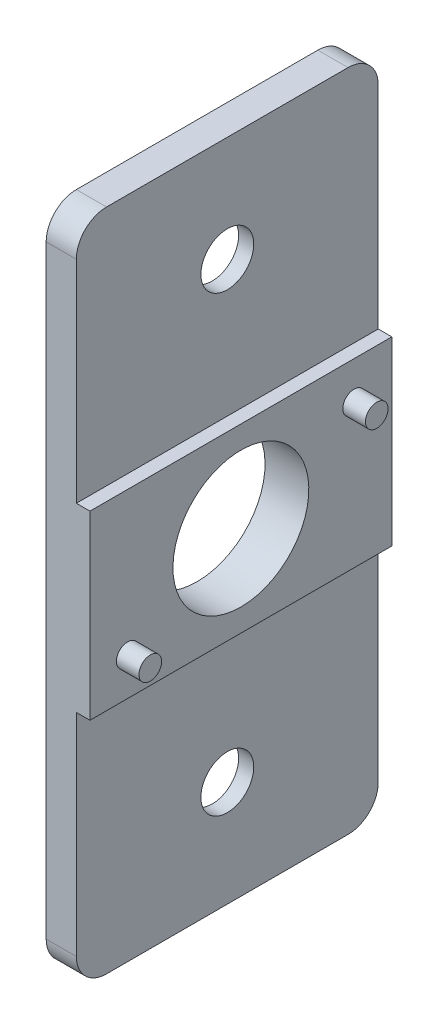
ISO-10303-21;
HEADER;
FILE_DESCRIPTION(('STEP AP214'),'2;1');
FILE_NAME('part.step','',(''),(''),'','','');
FILE_SCHEMA(('AUTOMOTIVE_DESIGN { 1 0 10303 214 1 1 1 1 }'));
ENDSEC;
DATA;
#1=APPLICATION_CONTEXT('core data for automotive mechanical design processes');
#2=APPLICATION_PROTOCOL_DEFINITION('international standard','automotive_design',2000,#1);
#3=PRODUCT_CONTEXT('',#1,'mechanical');
#4=PRODUCT('Part','Part','',(#3));
#5=PRODUCT_RELATED_PRODUCT_CATEGORY('part','',(#4));
#6=PRODUCT_DEFINITION_FORMATION('','',#4);
#7=PRODUCT_DEFINITION_CONTEXT('part definition',#1,'design');
#8=PRODUCT_DEFINITION('design','',#6,#7);
#9=PRODUCT_DEFINITION_SHAPE('','',#8);
#10=(LENGTH_UNIT() NAMED_UNIT(*) SI_UNIT(.MILLI.,.METRE.));
#11=(NAMED_UNIT(*) PLANE_ANGLE_UNIT() SI_UNIT($,.RADIAN.));
#12=(NAMED_UNIT(*) SI_UNIT($,.STERADIAN.) SOLID_ANGLE_UNIT());
#13=UNCERTAINTY_MEASURE_WITH_UNIT(LENGTH_MEASURE(1.E-05),#10,'distance_accuracy_value','');
#14=(GEOMETRIC_REPRESENTATION_CONTEXT(3) GLOBAL_UNCERTAINTY_ASSIGNED_CONTEXT((#13)) GLOBAL_UNIT_ASSIGNED_CONTEXT((#10,
#11,#12)) REPRESENTATION_CONTEXT('',''));
#15=CARTESIAN_POINT('',(0.,0.,0.));
#16=DIRECTION('',(0.,0.,1.));
#17=DIRECTION('',(1.,0.,0.));
#18=AXIS2_PLACEMENT_3D('',#15,#16,#17);
#19=CARTESIAN_POINT('',(2.9,-37.,10.));
#20=DIRECTION('',(-1.,0.,0.));
#21=DIRECTION('',(0.,-1.,0.));
#22=AXIS2_PLACEMENT_3D('',#19,#20,#21);
#23=CYLINDRICAL_SURFACE('',#22,1.75);
#24=CARTESIAN_POINT('',(2.,-37.,10.));
#25=DIRECTION('',(-1.,0.,0.));
#26=DIRECTION('',(0.,0.,1.));
#27=AXIS2_PLACEMENT_3D('',#24,#25,#26);
#28=CIRCLE('',#27,1.75);
#29=CARTESIAN_POINT('',(2.,-37.,11.75));
#30=VERTEX_POINT('',#29);
#31=EDGE_CURVE('E308',#30,#30,#28,.T.);
#32=ORIENTED_EDGE('',*,*,#31,.F.);
#33=EDGE_LOOP('',(#32));
#34=FACE_BOUND('',#33,.T.);
#35=CARTESIAN_POINT('',(1.,-37.,10.));
#36=DIRECTION('',(-1.,0.,0.));
#37=DIRECTION('',(0.,0.,1.));
#38=AXIS2_PLACEMENT_3D('',#35,#36,#37);
#39=CIRCLE('',#38,1.75);
#40=CARTESIAN_POINT('',(1.,-37.,11.75));
#41=VERTEX_POINT('',#40);
#42=EDGE_CURVE('E38',#41,#41,#39,.F.);
#43=ORIENTED_EDGE('',*,*,#42,.F.);
#44=EDGE_LOOP('',(#43));
#45=FACE_BOUND('',#44,.T.);
#46=ADVANCED_FACE('F34',(#34,#45),#23,.F.);
#47=CARTESIAN_POINT('',(2.9,-7.,10.));
#48=DIRECTION('',(-1.,0.,0.));
#49=DIRECTION('',(0.,-1.,0.));
#50=AXIS2_PLACEMENT_3D('',#47,#48,#49);
#51=CYLINDRICAL_SURFACE('',#50,1.75);
#52=CARTESIAN_POINT('',(2.,-7.,10.));
#53=DIRECTION('',(-1.,0.,0.));
#54=DIRECTION('',(0.,0.,1.));
#55=AXIS2_PLACEMENT_3D('',#52,#53,#54);
#56=CIRCLE('',#55,1.75);
#57=CARTESIAN_POINT('',(2.,-7.,11.75));
#58=VERTEX_POINT('',#57);
#59=EDGE_CURVE('E331',#58,#58,#56,.T.);
#60=ORIENTED_EDGE('',*,*,#59,.F.);
#61=EDGE_LOOP('',(#60));
#62=FACE_BOUND('',#61,.T.);
#63=CARTESIAN_POINT('',(1.,-7.,10.));
#64=DIRECTION('',(-1.,0.,0.));
#65=DIRECTION('',(0.,0.,1.));
#66=AXIS2_PLACEMENT_3D('',#63,#64,#65);
#67=CIRCLE('',#66,1.75);
#68=CARTESIAN_POINT('',(1.,-7.,11.75));
#69=VERTEX_POINT('',#68);
#70=EDGE_CURVE('E288',#69,#69,#67,.F.);
#71=ORIENTED_EDGE('',*,*,#70,.F.);
#72=EDGE_LOOP('',(#71));
#73=FACE_BOUND('',#72,.T.);
#74=ADVANCED_FACE('F411',(#62,#73),#51,.F.);
#75=CARTESIAN_POINT('',(2.9,-28.,20.));
#76=DIRECTION('',(-1.,0.,0.));
#77=DIRECTION('',(0.,0.,1.));
#78=AXIS2_PLACEMENT_3D('',#75,#76,#77);
#79=PLANE('',#78);
#80=CARTESIAN_POINT('',(2.9,-25.5,17.5));
#81=DIRECTION('',(-1.,0.,0.));
#82=DIRECTION('',(0.,0.,1.));
#83=AXIS2_PLACEMENT_3D('',#80,#81,#82);
#84=CIRCLE('',#83,0.750000000000002);
#85=CARTESIAN_POINT('',(2.9,-25.5,18.25));
#86=VERTEX_POINT('',#85);
#87=EDGE_CURVE('E364',#86,#86,#84,.F.);
#88=ORIENTED_EDGE('',*,*,#87,.F.);
#89=EDGE_LOOP('',(#88));
#90=FACE_BOUND('',#89,.T.);
#91=CARTESIAN_POINT('',(2.9,-22.,10.));
#92=DIRECTION('',(-1.,0.,0.));
#93=DIRECTION('',(0.,-1.,0.));
#94=AXIS2_PLACEMENT_3D('',#91,#92,#93);
#95=CIRCLE('',#94,4.5);
#96=CARTESIAN_POINT('',(2.9,-26.5,10.));
#97=VERTEX_POINT('',#96);
#98=EDGE_CURVE('E305',#97,#97,#95,.T.);
#99=ORIENTED_EDGE('',*,*,#98,.T.);
#100=EDGE_LOOP('',(#99));
#101=FACE_BOUND('',#100,.T.);
#102=DIRECTION('',(0.,1.,0.));
#103=VECTOR('',#102,1.);
#104=CARTESIAN_POINT('',(2.9,-28.,0.));
#105=LINE('',#104,#103);
#106=CARTESIAN_POINT('',(2.9,-28.,0.));
#107=VERTEX_POINT('',#106);
#108=CARTESIAN_POINT('',(2.9,-16.,0.));
#109=VERTEX_POINT('',#108);
#110=EDGE_CURVE('E335',#107,#109,#105,.T.);
#111=ORIENTED_EDGE('',*,*,#110,.T.);
#112=DIRECTION('',(0.,0.,-1.));
#113=VECTOR('',#112,1.);
#114=CARTESIAN_POINT('',(2.9,-16.,20.));
#115=LINE('',#114,#113);
#116=CARTESIAN_POINT('',(2.9,-16.,20.));
#117=VERTEX_POINT('',#116);
#118=EDGE_CURVE('E346',#117,#109,#115,.T.);
#119=ORIENTED_EDGE('',*,*,#118,.F.);
#120=DIRECTION('',(0.,1.,0.));
#121=VECTOR('',#120,1.);
#122=CARTESIAN_POINT('',(2.9,-28.,20.));
#123=LINE('',#122,#121);
#124=CARTESIAN_POINT('',(2.9,-28.,20.));
#125=VERTEX_POINT('',#124);
#126=EDGE_CURVE('E319',#125,#117,#123,.T.);
#127=ORIENTED_EDGE('',*,*,#126,.F.);
#128=DIRECTION('',(0.,0.,-1.));
#129=VECTOR('',#128,1.);
#130=CARTESIAN_POINT('',(2.9,-28.,20.));
#131=LINE('',#130,#129);
#132=EDGE_CURVE('E349',#125,#107,#131,.T.);
#133=ORIENTED_EDGE('',*,*,#132,.T.);
#134=EDGE_LOOP('',(#111,#119,#127,#133));
#135=FACE_BOUND('',#134,.T.);
#136=CARTESIAN_POINT('',(2.9,-18.5,2.5));
#137=DIRECTION('',(-1.,0.,0.));
#138=DIRECTION('',(0.,0.,1.));
#139=AXIS2_PLACEMENT_3D('',#136,#137,#138);
#140=CIRCLE('',#139,0.75);
#141=CARTESIAN_POINT('',(2.9,-18.5,3.25));
#142=VERTEX_POINT('',#141);
#143=EDGE_CURVE('E371',#142,#142,#140,.F.);
#144=ORIENTED_EDGE('',*,*,#143,.F.);
#145=EDGE_LOOP('',(#144));
#146=FACE_BOUND('',#145,.T.);
#147=ADVANCED_FACE('F413',(#90,#101,#135,#146),#79,.F.);
#148=CARTESIAN_POINT('',(2.,0.,20.));
#149=DIRECTION('',(0.,-1.,0.));
#150=DIRECTION('',(1.,0.,0.));
#151=AXIS2_PLACEMENT_3D('',#148,#149,#150);
#152=PLANE('',#151);
#153=DIRECTION('',(0.,0.,-1.));
#154=VECTOR('',#153,1.);
#155=CARTESIAN_POINT('',(2.,0.,20.));
#156=LINE('',#155,#154);
#157=CARTESIAN_POINT('',(2.,0.,18.));
#158=VERTEX_POINT('',#157);
#159=CARTESIAN_POINT('',(2.,0.,2.));
#160=VERTEX_POINT('',#159);
#161=EDGE_CURVE('E326',#158,#160,#156,.T.);
#162=ORIENTED_EDGE('',*,*,#161,.T.);
#163=DIRECTION('',(-1.,0.,0.));
#164=VECTOR('',#163,1.);
#165=CARTESIAN_POINT('',(2.,0.,2.));
#166=LINE('',#165,#164);
#167=CARTESIAN_POINT('',(0.,0.,2.));
#168=VERTEX_POINT('',#167);
#169=EDGE_CURVE('E376',#160,#168,#166,.T.);
#170=ORIENTED_EDGE('',*,*,#169,.T.);
#171=DIRECTION('',(0.,0.,-1.));
#172=VECTOR('',#171,1.);
#173=CARTESIAN_POINT('',(0.,0.,20.));
#174=LINE('',#173,#172);
#175=CARTESIAN_POINT('',(0.,0.,18.));
#176=VERTEX_POINT('',#175);
#177=EDGE_CURVE('E361',#176,#168,#174,.T.);
#178=ORIENTED_EDGE('',*,*,#177,.F.);
#179=DIRECTION('',(-1.,0.,0.));
#180=VECTOR('',#179,1.);
#181=CARTESIAN_POINT('',(2.,0.,18.));
#182=LINE('',#181,#180);
#183=EDGE_CURVE('E374',#176,#158,#182,.F.);
#184=ORIENTED_EDGE('',*,*,#183,.T.);
#185=EDGE_LOOP('',(#162,#170,#178,#184));
#186=FACE_BOUND('',#185,.T.);
#187=ADVANCED_FACE('F421',(#186),#152,.F.);
#188=CARTESIAN_POINT('',(0.,0.,20.));
#189=DIRECTION('',(1.,0.,0.));
#190=DIRECTION('',(0.,0.,-1.));
#191=AXIS2_PLACEMENT_3D('',#188,#189,#190);
#192=PLANE('',#191);
#193=DIRECTION('',(0.,0.866025403784439,0.499999999999999));
#194=VECTOR('',#193,1.);
#195=CARTESIAN_POINT('',(0.,-40.25,11.8763883748663));
#196=LINE('',#195,#194);
#197=CARTESIAN_POINT('',(0.,-40.25,11.8763883748663));
#198=VERTEX_POINT('',#197);
#199=CARTESIAN_POINT('',(0.,-37.,13.7527767497326));
#200=VERTEX_POINT('',#199);
#201=EDGE_CURVE('E232',#198,#200,#196,.T.);
#202=ORIENTED_EDGE('',*,*,#201,.F.);
#203=DIRECTION('',(0.,0.,1.));
#204=VECTOR('',#203,1.);
#205=CARTESIAN_POINT('',(0.,-40.25,8.12361162513372));
#206=LINE('',#205,#204);
#207=CARTESIAN_POINT('',(0.,-40.25,8.12361162513372));
#208=VERTEX_POINT('',#207);
#209=EDGE_CURVE('E51',#208,#198,#206,.T.);
#210=ORIENTED_EDGE('',*,*,#209,.F.);
#211=DIRECTION('',(0.,-0.866025403784439,0.499999999999999));
#212=VECTOR('',#211,1.);
#213=CARTESIAN_POINT('',(0.,-37.,6.24722325026744));
#214=LINE('',#213,#212);
#215=CARTESIAN_POINT('',(0.,-37.,6.24722325026744));
#216=VERTEX_POINT('',#215);
#217=EDGE_CURVE('E218',#216,#208,#214,.T.);
#218=ORIENTED_EDGE('',*,*,#217,.F.);
#219=DIRECTION('',(0.,-0.866025403784439,-0.5));
#220=VECTOR('',#219,1.);
#221=CARTESIAN_POINT('',(0.,-33.75,8.12361162513371));
#222=LINE('',#221,#220);
#223=CARTESIAN_POINT('',(0.,-33.75,8.12361162513371));
#224=VERTEX_POINT('',#223);
#225=EDGE_CURVE('E221',#224,#216,#222,.T.);
#226=ORIENTED_EDGE('',*,*,#225,.F.);
#227=DIRECTION('',(0.,0.,-1.));
#228=VECTOR('',#227,1.);
#229=CARTESIAN_POINT('',(0.,-33.75,11.8763883748663));
#230=LINE('',#229,#228);
#231=CARTESIAN_POINT('',(0.,-33.75,11.8763883748663));
#232=VERTEX_POINT('',#231);
#233=EDGE_CURVE('E237',#232,#224,#230,.T.);
#234=ORIENTED_EDGE('',*,*,#233,.F.);
#235=DIRECTION('',(0.,0.866025403784438,-0.5));
#236=VECTOR('',#235,1.);
#237=CARTESIAN_POINT('',(0.,-37.,13.7527767497326));
#238=LINE('',#237,#236);
#239=EDGE_CURVE('E234',#200,#232,#238,.T.);
#240=ORIENTED_EDGE('',*,*,#239,.F.);
#241=EDGE_LOOP('',(#202,#210,#218,#226,#234,#240));
#242=FACE_BOUND('',#241,.T.);
#243=DIRECTION('',(0.,0.866025403784439,0.5));
#244=VECTOR('',#243,1.);
#245=CARTESIAN_POINT('',(0.,-10.25,11.8763883748663));
#246=LINE('',#245,#244);
#247=CARTESIAN_POINT('',(0.,-10.25,11.8763883748663));
#248=VERTEX_POINT('',#247);
#249=CARTESIAN_POINT('',(0.,-7.,13.7527767497326));
#250=VERTEX_POINT('',#249);
#251=EDGE_CURVE('E272',#248,#250,#246,.T.);
#252=ORIENTED_EDGE('',*,*,#251,.F.);
#253=DIRECTION('',(0.,0.,1.));
#254=VECTOR('',#253,1.);
#255=CARTESIAN_POINT('',(0.,-10.25,8.12361162513372));
#256=LINE('',#255,#254);
#257=CARTESIAN_POINT('',(0.,-10.25,8.12361162513372));
#258=VERTEX_POINT('',#257);
#259=EDGE_CURVE('E59',#258,#248,#256,.T.);
#260=ORIENTED_EDGE('',*,*,#259,.F.);
#261=DIRECTION('',(0.,-0.866025403784438,0.5));
#262=VECTOR('',#261,1.);
#263=CARTESIAN_POINT('',(0.,-7.,6.24722325026743));
#264=LINE('',#263,#262);
#265=CARTESIAN_POINT('',(0.,-7.,6.24722325026743));
#266=VERTEX_POINT('',#265);
#267=EDGE_CURVE('E255',#266,#258,#264,.T.);
#268=ORIENTED_EDGE('',*,*,#267,.F.);
#269=DIRECTION('',(0.,-0.866025403784439,-0.5));
#270=VECTOR('',#269,1.);
#271=CARTESIAN_POINT('',(0.,-3.75,8.12361162513372));
#272=LINE('',#271,#270);
#273=CARTESIAN_POINT('',(0.,-3.75,8.12361162513372));
#274=VERTEX_POINT('',#273);
#275=EDGE_CURVE('E281',#274,#266,#272,.T.);
#276=ORIENTED_EDGE('',*,*,#275,.F.);
#277=DIRECTION('',(0.,0.,-1.));
#278=VECTOR('',#277,1.);
#279=CARTESIAN_POINT('',(0.,-3.75,11.8763883748663));
#280=LINE('',#279,#278);
#281=CARTESIAN_POINT('',(0.,-3.75,11.8763883748663));
#282=VERTEX_POINT('',#281);
#283=EDGE_CURVE('E278',#282,#274,#280,.T.);
#284=ORIENTED_EDGE('',*,*,#283,.F.);
#285=DIRECTION('',(0.,0.866025403784439,-0.5));
#286=VECTOR('',#285,1.);
#287=CARTESIAN_POINT('',(0.,-7.,13.7527767497326));
#288=LINE('',#287,#286);
#289=EDGE_CURVE('E275',#250,#282,#288,.T.);
#290=ORIENTED_EDGE('',*,*,#289,.F.);
#291=EDGE_LOOP('',(#252,#260,#268,#276,#284,#290));
#292=FACE_BOUND('',#291,.T.);
#293=CARTESIAN_POINT('',(0.,-22.,10.));
#294=DIRECTION('',(-1.,0.,0.));
#295=DIRECTION('',(0.,-1.,0.));
#296=AXIS2_PLACEMENT_3D('',#293,#294,#295);
#297=CIRCLE('',#296,4.5);
#298=CARTESIAN_POINT('',(0.,-26.5,10.));
#299=VERTEX_POINT('',#298);
#300=EDGE_CURVE('E304',#299,#299,#297,.T.);
#301=ORIENTED_EDGE('',*,*,#300,.F.);
#302=EDGE_LOOP('',(#301));
#303=FACE_BOUND('',#302,.T.);
#304=ORIENTED_EDGE('',*,*,#177,.T.);
#305=CARTESIAN_POINT('',(0.,-2.,2.));
#306=DIRECTION('',(1.,0.,0.));
#307=DIRECTION('',(0.,0.,-1.));
#308=AXIS2_PLACEMENT_3D('',#305,#306,#307);
#309=CIRCLE('',#308,2.);
#310=CARTESIAN_POINT('',(0.,-2.,0.));
#311=VERTEX_POINT('',#310);
#312=EDGE_CURVE('E385',#168,#311,#309,.F.);
#313=ORIENTED_EDGE('',*,*,#312,.T.);
#314=DIRECTION('',(0.,-1.,0.));
#315=VECTOR('',#314,1.);
#316=CARTESIAN_POINT('',(0.,0.,0.));
#317=LINE('',#316,#315);
#318=CARTESIAN_POINT('',(0.,-42.,0.));
#319=VERTEX_POINT('',#318);
#320=EDGE_CURVE('E327',#311,#319,#317,.T.);
#321=ORIENTED_EDGE('',*,*,#320,.T.);
#322=CARTESIAN_POINT('',(0.,-42.,2.));
#323=DIRECTION('',(1.,0.,0.));
#324=DIRECTION('',(0.,0.,-1.));
#325=AXIS2_PLACEMENT_3D('',#322,#323,#324);
#326=CIRCLE('',#325,2.);
#327=CARTESIAN_POINT('',(0.,-44.,2.));
#328=VERTEX_POINT('',#327);
#329=EDGE_CURVE('E379',#319,#328,#326,.F.);
#330=ORIENTED_EDGE('',*,*,#329,.T.);
#331=DIRECTION('',(0.,0.,-1.));
#332=VECTOR('',#331,1.);
#333=CARTESIAN_POINT('',(0.,-44.,20.));
#334=LINE('',#333,#332);
#335=CARTESIAN_POINT('',(0.,-44.,18.));
#336=VERTEX_POINT('',#335);
#337=EDGE_CURVE('E358',#336,#328,#334,.T.);
#338=ORIENTED_EDGE('',*,*,#337,.F.);
#339=CARTESIAN_POINT('',(0.,-42.,18.));
#340=DIRECTION('',(1.,0.,0.));
#341=DIRECTION('',(0.,0.,-1.));
#342=AXIS2_PLACEMENT_3D('',#339,#340,#341);
#343=CIRCLE('',#342,2.);
#344=CARTESIAN_POINT('',(0.,-42.,20.));
#345=VERTEX_POINT('',#344);
#346=EDGE_CURVE('E381',#336,#345,#343,.F.);
#347=ORIENTED_EDGE('',*,*,#346,.T.);
#348=DIRECTION('',(0.,-1.,0.));
#349=VECTOR('',#348,1.);
#350=CARTESIAN_POINT('',(0.,0.,20.));
#351=LINE('',#350,#349);
#352=CARTESIAN_POINT('',(0.,-2.,20.));
#353=VERTEX_POINT('',#352);
#354=EDGE_CURVE('E311',#353,#345,#351,.T.);
#355=ORIENTED_EDGE('',*,*,#354,.F.);
#356=CARTESIAN_POINT('',(0.,-2.,18.));
#357=DIRECTION('',(1.,0.,0.));
#358=DIRECTION('',(0.,0.,-1.));
#359=AXIS2_PLACEMENT_3D('',#356,#357,#358);
#360=CIRCLE('',#359,2.);
#361=EDGE_CURVE('E383',#353,#176,#360,.F.);
#362=ORIENTED_EDGE('',*,*,#361,.T.);
#363=EDGE_LOOP('',(#304,#313,#321,#330,#338,#347,#355,#362));
#364=FACE_BOUND('',#363,.T.);
#365=ADVANCED_FACE('F457',(#242,#292,#303,#364),#192,.F.);
#366=CARTESIAN_POINT('',(0.,-44.,20.));
#367=DIRECTION('',(0.,1.,0.));
#368=DIRECTION('',(0.,0.,1.));
#369=AXIS2_PLACEMENT_3D('',#366,#367,#368);
#370=PLANE('',#369);
#371=DIRECTION('',(0.,0.,-1.));
#372=VECTOR('',#371,1.);
#373=CARTESIAN_POINT('',(2.,-44.,20.));
#374=LINE('',#373,#372);
#375=CARTESIAN_POINT('',(2.,-44.,18.));
#376=VERTEX_POINT('',#375);
#377=CARTESIAN_POINT('',(2.,-44.,2.));
#378=VERTEX_POINT('',#377);
#379=EDGE_CURVE('E355',#376,#378,#374,.T.);
#380=ORIENTED_EDGE('',*,*,#379,.F.);
#381=DIRECTION('',(1.,0.,0.));
#382=VECTOR('',#381,1.);
#383=CARTESIAN_POINT('',(0.,-44.,18.));
#384=LINE('',#383,#382);
#385=EDGE_CURVE('E11',#376,#336,#384,.F.);
#386=ORIENTED_EDGE('',*,*,#385,.T.);
#387=ORIENTED_EDGE('',*,*,#337,.T.);
#388=DIRECTION('',(1.,0.,0.));
#389=VECTOR('',#388,1.);
#390=CARTESIAN_POINT('',(0.,-44.,2.));
#391=LINE('',#390,#389);
#392=EDGE_CURVE('E43',#328,#378,#391,.T.);
#393=ORIENTED_EDGE('',*,*,#392,.T.);
#394=EDGE_LOOP('',(#380,#386,#387,#393));
#395=FACE_BOUND('',#394,.T.);
#396=ADVANCED_FACE('F453',(#395),#370,.F.);
#397=CARTESIAN_POINT('',(2.,-44.,20.));
#398=DIRECTION('',(-1.,0.,0.));
#399=DIRECTION('',(0.,0.,1.));
#400=AXIS2_PLACEMENT_3D('',#397,#398,#399);
#401=PLANE('',#400);
#402=ORIENTED_EDGE('',*,*,#31,.T.);
#403=EDGE_LOOP('',(#402));
#404=FACE_BOUND('',#403,.T.);
#405=DIRECTION('',(0.,1.,0.));
#406=VECTOR('',#405,1.);
#407=CARTESIAN_POINT('',(2.,-44.,20.));
#408=LINE('',#407,#406);
#409=CARTESIAN_POINT('',(2.,-42.,20.));
#410=VERTEX_POINT('',#409);
#411=CARTESIAN_POINT('',(2.,-28.,20.));
#412=VERTEX_POINT('',#411);
#413=EDGE_CURVE('E314',#410,#412,#408,.T.);
#414=ORIENTED_EDGE('',*,*,#413,.F.);
#415=CARTESIAN_POINT('',(2.,-42.,18.));
#416=DIRECTION('',(-1.,0.,0.));
#417=DIRECTION('',(0.,0.,1.));
#418=AXIS2_PLACEMENT_3D('',#415,#416,#417);
#419=CIRCLE('',#418,2.);
#420=EDGE_CURVE('E403',#410,#376,#419,.F.);
#421=ORIENTED_EDGE('',*,*,#420,.T.);
#422=ORIENTED_EDGE('',*,*,#379,.T.);
#423=CARTESIAN_POINT('',(2.,-42.,2.));
#424=DIRECTION('',(-1.,0.,0.));
#425=DIRECTION('',(0.,0.,1.));
#426=AXIS2_PLACEMENT_3D('',#423,#424,#425);
#427=CIRCLE('',#426,2.);
#428=CARTESIAN_POINT('',(2.,-42.,0.));
#429=VERTEX_POINT('',#428);
#430=EDGE_CURVE('E401',#378,#429,#427,.F.);
#431=ORIENTED_EDGE('',*,*,#430,.T.);
#432=DIRECTION('',(0.,1.,0.));
#433=VECTOR('',#432,1.);
#434=CARTESIAN_POINT('',(2.,-44.,0.));
#435=LINE('',#434,#433);
#436=CARTESIAN_POINT('',(2.,-28.,0.));
#437=VERTEX_POINT('',#436);
#438=EDGE_CURVE('E330',#429,#437,#435,.T.);
#439=ORIENTED_EDGE('',*,*,#438,.T.);
#440=DIRECTION('',(0.,0.,-1.));
#441=VECTOR('',#440,1.);
#442=CARTESIAN_POINT('',(2.,-28.,20.));
#443=LINE('',#442,#441);
#444=EDGE_CURVE('E352',#412,#437,#443,.T.);
#445=ORIENTED_EDGE('',*,*,#444,.F.);
#446=EDGE_LOOP('',(#414,#421,#422,#431,#439,#445));
#447=FACE_BOUND('',#446,.T.);
#448=ADVANCED_FACE('F449',(#404,#447),#401,.F.);
#449=CARTESIAN_POINT('',(2.,-28.,20.));
#450=DIRECTION('',(0.,1.,0.));
#451=DIRECTION('',(0.,0.,1.));
#452=AXIS2_PLACEMENT_3D('',#449,#450,#451);
#453=PLANE('',#452);
#454=DIRECTION('',(1.,0.,0.));
#455=VECTOR('',#454,1.);
#456=CARTESIAN_POINT('',(2.,-28.,0.));
#457=LINE('',#456,#455);
#458=EDGE_CURVE('E333',#437,#107,#457,.T.);
#459=ORIENTED_EDGE('',*,*,#458,.T.);
#460=ORIENTED_EDGE('',*,*,#132,.F.);
#461=DIRECTION('',(1.,0.,0.));
#462=VECTOR('',#461,1.);
#463=CARTESIAN_POINT('',(2.,-28.,20.));
#464=LINE('',#463,#462);
#465=EDGE_CURVE('E317',#412,#125,#464,.T.);
#466=ORIENTED_EDGE('',*,*,#465,.F.);
#467=ORIENTED_EDGE('',*,*,#444,.T.);
#468=EDGE_LOOP('',(#459,#460,#466,#467));
#469=FACE_BOUND('',#468,.T.);
#470=ADVANCED_FACE('F444',(#469),#453,.F.);
#471=CARTESIAN_POINT('',(2.9,-16.,20.));
#472=DIRECTION('',(0.,-1.,0.));
#473=DIRECTION('',(0.,0.,-1.));
#474=AXIS2_PLACEMENT_3D('',#471,#472,#473);
#475=PLANE('',#474);
#476=DIRECTION('',(-1.,0.,0.));
#477=VECTOR('',#476,1.);
#478=CARTESIAN_POINT('',(2.9,-16.,0.));
#479=LINE('',#478,#477);
#480=CARTESIAN_POINT('',(2.,-16.,0.));
#481=VERTEX_POINT('',#480);
#482=EDGE_CURVE('E337',#109,#481,#479,.T.);
#483=ORIENTED_EDGE('',*,*,#482,.T.);
#484=DIRECTION('',(0.,0.,-1.));
#485=VECTOR('',#484,1.);
#486=CARTESIAN_POINT('',(2.,-16.,20.));
#487=LINE('',#486,#485);
#488=CARTESIAN_POINT('',(2.,-16.,20.));
#489=VERTEX_POINT('',#488);
#490=EDGE_CURVE('E343',#489,#481,#487,.T.);
#491=ORIENTED_EDGE('',*,*,#490,.F.);
#492=DIRECTION('',(-1.,0.,0.));
#493=VECTOR('',#492,1.);
#494=CARTESIAN_POINT('',(2.9,-16.,20.));
#495=LINE('',#494,#493);
#496=EDGE_CURVE('E321',#117,#489,#495,.T.);
#497=ORIENTED_EDGE('',*,*,#496,.F.);
#498=ORIENTED_EDGE('',*,*,#118,.T.);
#499=EDGE_LOOP('',(#483,#491,#497,#498));
#500=FACE_BOUND('',#499,.T.);
#501=ADVANCED_FACE('F441',(#500),#475,.F.);
#502=CARTESIAN_POINT('',(2.,-16.,20.));
#503=DIRECTION('',(-1.,0.,0.));
#504=DIRECTION('',(0.,0.,1.));
#505=AXIS2_PLACEMENT_3D('',#502,#503,#504);
#506=PLANE('',#505);
#507=ORIENTED_EDGE('',*,*,#59,.T.);
#508=EDGE_LOOP('',(#507));
#509=FACE_BOUND('',#508,.T.);
#510=DIRECTION('',(0.,1.,0.));
#511=VECTOR('',#510,1.);
#512=CARTESIAN_POINT('',(2.,-16.,0.));
#513=LINE('',#512,#511);
#514=CARTESIAN_POINT('',(2.,-2.,0.));
#515=VERTEX_POINT('',#514);
#516=EDGE_CURVE('E315',#481,#515,#513,.T.);
#517=ORIENTED_EDGE('',*,*,#516,.T.);
#518=CARTESIAN_POINT('',(2.,-2.,2.));
#519=DIRECTION('',(-1.,0.,0.));
#520=DIRECTION('',(0.,0.,1.));
#521=AXIS2_PLACEMENT_3D('',#518,#519,#520);
#522=CIRCLE('',#521,2.);
#523=EDGE_CURVE('E393',#515,#160,#522,.F.);
#524=ORIENTED_EDGE('',*,*,#523,.T.);
#525=ORIENTED_EDGE('',*,*,#161,.F.);
#526=CARTESIAN_POINT('',(2.,-2.,18.));
#527=DIRECTION('',(-1.,0.,0.));
#528=DIRECTION('',(0.,0.,1.));
#529=AXIS2_PLACEMENT_3D('',#526,#527,#528);
#530=CIRCLE('',#529,2.);
#531=CARTESIAN_POINT('',(2.,-2.,20.));
#532=VERTEX_POINT('',#531);
#533=EDGE_CURVE('E391',#158,#532,#530,.F.);
#534=ORIENTED_EDGE('',*,*,#533,.T.);
#535=DIRECTION('',(0.,1.,0.));
#536=VECTOR('',#535,1.);
#537=CARTESIAN_POINT('',(2.,-16.,20.));
#538=LINE('',#537,#536);
#539=EDGE_CURVE('E323',#489,#532,#538,.T.);
#540=ORIENTED_EDGE('',*,*,#539,.F.);
#541=ORIENTED_EDGE('',*,*,#490,.T.);
#542=EDGE_LOOP('',(#517,#524,#525,#534,#540,#541));
#543=FACE_BOUND('',#542,.T.);
#544=ADVANCED_FACE('F433',(#509,#543),#506,.F.);
#545=CARTESIAN_POINT('',(0.,0.,20.));
#546=DIRECTION('',(0.,0.,1.));
#547=DIRECTION('',(1.,0.,0.));
#548=AXIS2_PLACEMENT_3D('',#545,#546,#547);
#549=PLANE('',#548);
#550=ORIENTED_EDGE('',*,*,#539,.T.);
#551=DIRECTION('',(-1.,0.,0.));
#552=VECTOR('',#551,1.);
#553=CARTESIAN_POINT('',(0.,-2.,20.));
#554=LINE('',#553,#552);
#555=EDGE_CURVE('E398',#532,#353,#554,.T.);
#556=ORIENTED_EDGE('',*,*,#555,.T.);
#557=ORIENTED_EDGE('',*,*,#354,.T.);
#558=DIRECTION('',(1.,0.,0.));
#559=VECTOR('',#558,1.);
#560=CARTESIAN_POINT('',(2.,-42.,20.));
#561=LINE('',#560,#559);
#562=EDGE_CURVE('E395',#345,#410,#561,.T.);
#563=ORIENTED_EDGE('',*,*,#562,.T.);
#564=ORIENTED_EDGE('',*,*,#413,.T.);
#565=ORIENTED_EDGE('',*,*,#465,.T.);
#566=ORIENTED_EDGE('',*,*,#126,.T.);
#567=ORIENTED_EDGE('',*,*,#496,.T.);
#568=EDGE_LOOP('',(#550,#556,#557,#563,#564,#565,#566,#567));
#569=FACE_BOUND('',#568,.T.);
#570=ADVANCED_FACE('F429',(#569),#549,.T.);
#571=CARTESIAN_POINT('',(0.,0.,0.));
#572=DIRECTION('',(0.,0.,1.));
#573=DIRECTION('',(1.,0.,0.));
#574=AXIS2_PLACEMENT_3D('',#571,#572,#573);
#575=PLANE('',#574);
#576=ORIENTED_EDGE('',*,*,#320,.F.);
#577=DIRECTION('',(-1.,0.,0.));
#578=VECTOR('',#577,1.);
#579=CARTESIAN_POINT('',(0.,-2.,0.));
#580=LINE('',#579,#578);
#581=EDGE_CURVE('E389',#311,#515,#580,.F.);
#582=ORIENTED_EDGE('',*,*,#581,.T.);
#583=ORIENTED_EDGE('',*,*,#516,.F.);
#584=ORIENTED_EDGE('',*,*,#482,.F.);
#585=ORIENTED_EDGE('',*,*,#110,.F.);
#586=ORIENTED_EDGE('',*,*,#458,.F.);
#587=ORIENTED_EDGE('',*,*,#438,.F.);
#588=DIRECTION('',(1.,0.,0.));
#589=VECTOR('',#588,1.);
#590=CARTESIAN_POINT('',(0.,-42.,0.));
#591=LINE('',#590,#589);
#592=EDGE_CURVE('E387',#429,#319,#591,.F.);
#593=ORIENTED_EDGE('',*,*,#592,.T.);
#594=EDGE_LOOP('',(#576,#582,#583,#584,#585,#586,#587,#593));
#595=FACE_BOUND('',#594,.T.);
#596=ADVANCED_FACE('F432',(#595),#575,.F.);
#597=CARTESIAN_POINT('',(2.9,-22.,10.));
#598=DIRECTION('',(-1.,0.,0.));
#599=DIRECTION('',(0.,-1.,0.));
#600=AXIS2_PLACEMENT_3D('',#597,#598,#599);
#601=CYLINDRICAL_SURFACE('',#600,4.5);
#602=ORIENTED_EDGE('',*,*,#98,.F.);
#603=EDGE_LOOP('',(#602));
#604=FACE_BOUND('',#603,.T.);
#605=ORIENTED_EDGE('',*,*,#300,.T.);
#606=EDGE_LOOP('',(#605));
#607=FACE_BOUND('',#606,.T.);
#608=ADVANCED_FACE('F437',(#604,#607),#601,.F.);
#609=CARTESIAN_POINT('',(4.4,-25.5,17.5));
#610=DIRECTION('',(-1.,0.,0.));
#611=DIRECTION('',(0.,-1.,0.));
#612=AXIS2_PLACEMENT_3D('',#609,#610,#611);
#613=CYLINDRICAL_SURFACE('',#612,0.750000000000002);
#614=CARTESIAN_POINT('',(4.4,-25.5,17.5));
#615=DIRECTION('',(1.,0.,0.));
#616=DIRECTION('',(0.,1.,0.));
#617=AXIS2_PLACEMENT_3D('',#614,#615,#616);
#618=CIRCLE('',#617,0.750000000000002);
#619=CARTESIAN_POINT('',(4.4,-24.75,17.5));
#620=VERTEX_POINT('',#619);
#621=EDGE_CURVE('E301',#620,#620,#618,.T.);
#622=ORIENTED_EDGE('',*,*,#621,.F.);
#623=EDGE_LOOP('',(#622));
#624=FACE_BOUND('',#623,.T.);
#625=ORIENTED_EDGE('',*,*,#87,.T.);
#626=EDGE_LOOP('',(#625));
#627=FACE_BOUND('',#626,.T.);
#628=ADVANCED_FACE('F529',(#624,#627),#613,.T.);
#629=CARTESIAN_POINT('',(4.4,-25.5,17.5));
#630=DIRECTION('',(1.,0.,0.));
#631=DIRECTION('',(0.,1.,0.));
#632=AXIS2_PLACEMENT_3D('',#629,#630,#631);
#633=PLANE('',#632);
#634=ORIENTED_EDGE('',*,*,#621,.T.);
#635=EDGE_LOOP('',(#634));
#636=FACE_BOUND('',#635,.T.);
#637=ADVANCED_FACE('F520',(#636),#633,.T.);
#638=CARTESIAN_POINT('',(4.4,-18.5,2.5));
#639=DIRECTION('',(-1.,0.,0.));
#640=DIRECTION('',(0.,-1.,0.));
#641=AXIS2_PLACEMENT_3D('',#638,#639,#640);
#642=CYLINDRICAL_SURFACE('',#641,0.75);
#643=CARTESIAN_POINT('',(4.4,-18.5,2.5));
#644=DIRECTION('',(1.,0.,0.));
#645=DIRECTION('',(0.,1.,0.));
#646=AXIS2_PLACEMENT_3D('',#643,#644,#645);
#647=CIRCLE('',#646,0.75);
#648=CARTESIAN_POINT('',(4.4,-17.75,2.5));
#649=VERTEX_POINT('',#648);
#650=EDGE_CURVE('E298',#649,#649,#647,.T.);
#651=ORIENTED_EDGE('',*,*,#650,.F.);
#652=EDGE_LOOP('',(#651));
#653=FACE_BOUND('',#652,.T.);
#654=ORIENTED_EDGE('',*,*,#143,.T.);
#655=EDGE_LOOP('',(#654));
#656=FACE_BOUND('',#655,.T.);
#657=ADVANCED_FACE('F518',(#653,#656),#642,.T.);
#658=CARTESIAN_POINT('',(4.4,-18.5,2.5));
#659=DIRECTION('',(1.,0.,0.));
#660=DIRECTION('',(0.,1.,0.));
#661=AXIS2_PLACEMENT_3D('',#658,#659,#660);
#662=PLANE('',#661);
#663=ORIENTED_EDGE('',*,*,#650,.T.);
#664=EDGE_LOOP('',(#663));
#665=FACE_BOUND('',#664,.T.);
#666=ADVANCED_FACE('F468',(#665),#662,.T.);
#667=CARTESIAN_POINT('',(2.,-2.,2.));
#668=DIRECTION('',(-1.,0.,0.));
#669=DIRECTION('',(0.,-1.,0.));
#670=AXIS2_PLACEMENT_3D('',#667,#668,#669);
#671=CYLINDRICAL_SURFACE('',#670,2.);
#672=ORIENTED_EDGE('',*,*,#523,.F.);
#673=ORIENTED_EDGE('',*,*,#581,.F.);
#674=ORIENTED_EDGE('',*,*,#312,.F.);
#675=ORIENTED_EDGE('',*,*,#169,.F.);
#676=EDGE_LOOP('',(#672,#673,#674,#675));
#677=FACE_BOUND('',#676,.T.);
#678=ADVANCED_FACE('F464',(#677),#671,.T.);
#679=CARTESIAN_POINT('',(0.,-2.,18.));
#680=DIRECTION('',(1.,0.,0.));
#681=DIRECTION('',(0.,1.,0.));
#682=AXIS2_PLACEMENT_3D('',#679,#680,#681);
#683=CYLINDRICAL_SURFACE('',#682,2.);
#684=ORIENTED_EDGE('',*,*,#533,.F.);
#685=ORIENTED_EDGE('',*,*,#183,.F.);
#686=ORIENTED_EDGE('',*,*,#361,.F.);
#687=ORIENTED_EDGE('',*,*,#555,.F.);
#688=EDGE_LOOP('',(#684,#685,#686,#687));
#689=FACE_BOUND('',#688,.T.);
#690=ADVANCED_FACE('F467',(#689),#683,.T.);
#691=CARTESIAN_POINT('',(0.,-42.,18.));
#692=DIRECTION('',(-1.,0.,0.));
#693=DIRECTION('',(0.,0.,1.));
#694=AXIS2_PLACEMENT_3D('',#691,#692,#693);
#695=CYLINDRICAL_SURFACE('',#694,2.);
#696=ORIENTED_EDGE('',*,*,#346,.F.);
#697=ORIENTED_EDGE('',*,*,#385,.F.);
#698=ORIENTED_EDGE('',*,*,#420,.F.);
#699=ORIENTED_EDGE('',*,*,#562,.F.);
#700=EDGE_LOOP('',(#696,#697,#698,#699));
#701=FACE_BOUND('',#700,.T.);
#702=ADVANCED_FACE('F471',(#701),#695,.T.);
#703=CARTESIAN_POINT('',(0.,-42.,2.));
#704=DIRECTION('',(1.,0.,0.));
#705=DIRECTION('',(0.,0.,-1.));
#706=AXIS2_PLACEMENT_3D('',#703,#704,#705);
#707=CYLINDRICAL_SURFACE('',#706,2.);
#708=ORIENTED_EDGE('',*,*,#329,.F.);
#709=ORIENTED_EDGE('',*,*,#592,.F.);
#710=ORIENTED_EDGE('',*,*,#430,.F.);
#711=ORIENTED_EDGE('',*,*,#392,.F.);
#712=EDGE_LOOP('',(#708,#709,#710,#711));
#713=FACE_BOUND('',#712,.T.);
#714=ADVANCED_FACE('F36',(#713),#707,.T.);
#715=CARTESIAN_POINT('',(1.,0.,0.));
#716=DIRECTION('',(-1.,0.,0.));
#717=DIRECTION('',(0.,0.,1.));
#718=AXIS2_PLACEMENT_3D('',#715,#716,#717);
#719=PLANE('',#718);
#720=DIRECTION('',(0.,0.,1.));
#721=VECTOR('',#720,1.);
#722=CARTESIAN_POINT('',(1.,-10.25,8.12361162513372));
#723=LINE('',#722,#721);
#724=CARTESIAN_POINT('',(1.,-10.25,8.12361162513372));
#725=VERTEX_POINT('',#724);
#726=CARTESIAN_POINT('',(1.,-10.25,11.8763883748663));
#727=VERTEX_POINT('',#726);
#728=EDGE_CURVE('E251',#725,#727,#723,.T.);
#729=ORIENTED_EDGE('',*,*,#728,.T.);
#730=DIRECTION('',(0.,0.866025403784439,0.5));
#731=VECTOR('',#730,1.);
#732=CARTESIAN_POINT('',(1.,-10.25,11.8763883748663));
#733=LINE('',#732,#731);
#734=CARTESIAN_POINT('',(1.,-7.,13.7527767497326));
#735=VERTEX_POINT('',#734);
#736=EDGE_CURVE('E254',#727,#735,#733,.T.);
#737=ORIENTED_EDGE('',*,*,#736,.T.);
#738=DIRECTION('',(0.,0.866025403784439,-0.5));
#739=VECTOR('',#738,1.);
#740=CARTESIAN_POINT('',(1.,-7.,13.7527767497326));
#741=LINE('',#740,#739);
#742=CARTESIAN_POINT('',(1.,-3.75,11.8763883748663));
#743=VERTEX_POINT('',#742);
#744=EDGE_CURVE('E258',#735,#743,#741,.T.);
#745=ORIENTED_EDGE('',*,*,#744,.T.);
#746=DIRECTION('',(0.,0.,-1.));
#747=VECTOR('',#746,1.);
#748=CARTESIAN_POINT('',(1.,-3.75,11.8763883748663));
#749=LINE('',#748,#747);
#750=CARTESIAN_POINT('',(1.,-3.75,8.12361162513372));
#751=VERTEX_POINT('',#750);
#752=EDGE_CURVE('E261',#743,#751,#749,.T.);
#753=ORIENTED_EDGE('',*,*,#752,.T.);
#754=DIRECTION('',(0.,-0.866025403784439,-0.5));
#755=VECTOR('',#754,1.);
#756=CARTESIAN_POINT('',(1.,-3.75,8.12361162513372));
#757=LINE('',#756,#755);
#758=CARTESIAN_POINT('',(1.,-7.,6.24722325026743));
#759=VERTEX_POINT('',#758);
#760=EDGE_CURVE('E264',#751,#759,#757,.T.);
#761=ORIENTED_EDGE('',*,*,#760,.T.);
#762=DIRECTION('',(0.,-0.866025403784438,0.5));
#763=VECTOR('',#762,1.);
#764=CARTESIAN_POINT('',(1.,-7.,6.24722325026743));
#765=LINE('',#764,#763);
#766=EDGE_CURVE('E267',#759,#725,#765,.T.);
#767=ORIENTED_EDGE('',*,*,#766,.T.);
#768=EDGE_LOOP('',(#729,#737,#745,#753,#761,#767));
#769=FACE_BOUND('',#768,.T.);
#770=ORIENTED_EDGE('',*,*,#70,.T.);
#771=EDGE_LOOP('',(#770));
#772=FACE_BOUND('',#771,.T.);
#773=ADVANCED_FACE('F409',(#769,#772),#719,.T.);
#774=CARTESIAN_POINT('',(1.,-10.25,8.12361162513372));
#775=DIRECTION('',(0.,-1.,0.));
#776=DIRECTION('',(0.,0.,-1.));
#777=AXIS2_PLACEMENT_3D('',#774,#775,#776);
#778=PLANE('',#777);
#779=ORIENTED_EDGE('',*,*,#259,.T.);
#780=DIRECTION('',(-1.,0.,0.));
#781=VECTOR('',#780,1.);
#782=CARTESIAN_POINT('',(1.,-10.25,11.8763883748663));
#783=LINE('',#782,#781);
#784=EDGE_CURVE('E270',#727,#248,#783,.T.);
#785=ORIENTED_EDGE('',*,*,#784,.F.);
#786=ORIENTED_EDGE('',*,*,#728,.F.);
#787=DIRECTION('',(-1.,0.,0.));
#788=VECTOR('',#787,1.);
#789=CARTESIAN_POINT('',(1.,-10.25,8.12361162513372));
#790=LINE('',#789,#788);
#791=EDGE_CURVE('E286',#725,#258,#790,.T.);
#792=ORIENTED_EDGE('',*,*,#791,.T.);
#793=EDGE_LOOP('',(#779,#785,#786,#792));
#794=FACE_BOUND('',#793,.T.);
#795=ADVANCED_FACE('F647',(#794),#778,.F.);
#796=CARTESIAN_POINT('',(1.,-7.,6.24722325026743));
#797=DIRECTION('',(0.,-0.5,-0.866025403784439));
#798=DIRECTION('',(0.,0.866025403784438,-0.5));
#799=AXIS2_PLACEMENT_3D('',#796,#797,#798);
#800=PLANE('',#799);
#801=ORIENTED_EDGE('',*,*,#267,.T.);
#802=ORIENTED_EDGE('',*,*,#791,.F.);
#803=ORIENTED_EDGE('',*,*,#766,.F.);
#804=DIRECTION('',(-1.,0.,0.));
#805=VECTOR('',#804,1.);
#806=CARTESIAN_POINT('',(1.,-7.,6.24722325026743));
#807=LINE('',#806,#805);
#808=EDGE_CURVE('E289',#759,#266,#807,.T.);
#809=ORIENTED_EDGE('',*,*,#808,.T.);
#810=EDGE_LOOP('',(#801,#802,#803,#809));
#811=FACE_BOUND('',#810,.T.);
#812=ADVANCED_FACE('F656',(#811),#800,.F.);
#813=CARTESIAN_POINT('',(1.,-3.75,8.12361162513372));
#814=DIRECTION('',(0.,0.5,-0.866025403784439));
#815=DIRECTION('',(0.,0.866025403784439,0.5));
#816=AXIS2_PLACEMENT_3D('',#813,#814,#815);
#817=PLANE('',#816);
#818=ORIENTED_EDGE('',*,*,#275,.T.);
#819=ORIENTED_EDGE('',*,*,#808,.F.);
#820=ORIENTED_EDGE('',*,*,#760,.F.);
#821=DIRECTION('',(-1.,0.,0.));
#822=VECTOR('',#821,1.);
#823=CARTESIAN_POINT('',(1.,-3.75,8.12361162513372));
#824=LINE('',#823,#822);
#825=EDGE_CURVE('E291',#751,#274,#824,.T.);
#826=ORIENTED_EDGE('',*,*,#825,.T.);
#827=EDGE_LOOP('',(#818,#819,#820,#826));
#828=FACE_BOUND('',#827,.T.);
#829=ADVANCED_FACE('F663',(#828),#817,.F.);
#830=CARTESIAN_POINT('',(1.,-3.75,11.8763883748663));
#831=DIRECTION('',(0.,1.,0.));
#832=DIRECTION('',(0.,0.,1.));
#833=AXIS2_PLACEMENT_3D('',#830,#831,#832);
#834=PLANE('',#833);
#835=ORIENTED_EDGE('',*,*,#283,.T.);
#836=ORIENTED_EDGE('',*,*,#825,.F.);
#837=ORIENTED_EDGE('',*,*,#752,.F.);
#838=DIRECTION('',(-1.,0.,0.));
#839=VECTOR('',#838,1.);
#840=CARTESIAN_POINT('',(1.,-3.75,11.8763883748663));
#841=LINE('',#840,#839);
#842=EDGE_CURVE('E293',#743,#282,#841,.T.);
#843=ORIENTED_EDGE('',*,*,#842,.T.);
#844=EDGE_LOOP('',(#835,#836,#837,#843));
#845=FACE_BOUND('',#844,.T.);
#846=ADVANCED_FACE('F672',(#845),#834,.F.);
#847=CARTESIAN_POINT('',(1.,-7.,13.7527767497326));
#848=DIRECTION('',(0.,0.5,0.866025403784439));
#849=DIRECTION('',(0.,-0.866025403784439,0.5));
#850=AXIS2_PLACEMENT_3D('',#847,#848,#849);
#851=PLANE('',#850);
#852=ORIENTED_EDGE('',*,*,#289,.T.);
#853=ORIENTED_EDGE('',*,*,#842,.F.);
#854=ORIENTED_EDGE('',*,*,#744,.F.);
#855=DIRECTION('',(-1.,0.,0.));
#856=VECTOR('',#855,1.);
#857=CARTESIAN_POINT('',(1.,-7.,13.7527767497326));
#858=LINE('',#857,#856);
#859=EDGE_CURVE('E295',#735,#250,#858,.T.);
#860=ORIENTED_EDGE('',*,*,#859,.T.);
#861=EDGE_LOOP('',(#852,#853,#854,#860));
#862=FACE_BOUND('',#861,.T.);
#863=ADVANCED_FACE('F681',(#862),#851,.F.);
#864=CARTESIAN_POINT('',(1.,-10.25,11.8763883748663));
#865=DIRECTION('',(0.,-0.5,0.866025403784439));
#866=DIRECTION('',(0.,-0.866025403784439,-0.5));
#867=AXIS2_PLACEMENT_3D('',#864,#865,#866);
#868=PLANE('',#867);
#869=ORIENTED_EDGE('',*,*,#251,.T.);
#870=ORIENTED_EDGE('',*,*,#859,.F.);
#871=ORIENTED_EDGE('',*,*,#736,.F.);
#872=ORIENTED_EDGE('',*,*,#784,.T.);
#873=EDGE_LOOP('',(#869,#870,#871,#872));
#874=FACE_BOUND('',#873,.T.);
#875=ADVANCED_FACE('F690',(#874),#868,.F.);
#876=CARTESIAN_POINT('',(1.,0.,0.));
#877=DIRECTION('',(-1.,0.,0.));
#878=DIRECTION('',(0.,0.,1.));
#879=AXIS2_PLACEMENT_3D('',#876,#877,#878);
#880=PLANE('',#879);
#881=DIRECTION('',(0.,0.,1.));
#882=VECTOR('',#881,1.);
#883=CARTESIAN_POINT('',(1.,-40.25,8.12361162513372));
#884=LINE('',#883,#882);
#885=CARTESIAN_POINT('',(1.,-40.25,8.12361162513372));
#886=VERTEX_POINT('',#885);
#887=CARTESIAN_POINT('',(1.,-40.25,11.8763883748663));
#888=VERTEX_POINT('',#887);
#889=EDGE_CURVE('E198',#886,#888,#884,.T.);
#890=ORIENTED_EDGE('',*,*,#889,.T.);
#891=DIRECTION('',(0.,0.866025403784439,0.499999999999999));
#892=VECTOR('',#891,1.);
#893=CARTESIAN_POINT('',(1.,-40.25,11.8763883748663));
#894=LINE('',#893,#892);
#895=CARTESIAN_POINT('',(1.,-37.,13.7527767497326));
#896=VERTEX_POINT('',#895);
#897=EDGE_CURVE('E207',#888,#896,#894,.T.);
#898=ORIENTED_EDGE('',*,*,#897,.T.);
#899=DIRECTION('',(0.,0.866025403784438,-0.5));
#900=VECTOR('',#899,1.);
#901=CARTESIAN_POINT('',(1.,-37.,13.7527767497326));
#902=LINE('',#901,#900);
#903=CARTESIAN_POINT('',(1.,-33.75,11.8763883748663));
#904=VERTEX_POINT('',#903);
#905=EDGE_CURVE('E212',#896,#904,#902,.T.);
#906=ORIENTED_EDGE('',*,*,#905,.T.);
#907=DIRECTION('',(0.,0.,-1.));
#908=VECTOR('',#907,1.);
#909=CARTESIAN_POINT('',(1.,-33.75,11.8763883748663));
#910=LINE('',#909,#908);
#911=CARTESIAN_POINT('',(1.,-33.75,8.12361162513371));
#912=VERTEX_POINT('',#911);
#913=EDGE_CURVE('E225',#904,#912,#910,.T.);
#914=ORIENTED_EDGE('',*,*,#913,.T.);
#915=DIRECTION('',(0.,-0.866025403784439,-0.5));
#916=VECTOR('',#915,1.);
#917=CARTESIAN_POINT('',(1.,-33.75,8.12361162513371));
#918=LINE('',#917,#916);
#919=CARTESIAN_POINT('',(1.,-37.,6.24722325026744));
#920=VERTEX_POINT('',#919);
#921=EDGE_CURVE('E228',#912,#920,#918,.T.);
#922=ORIENTED_EDGE('',*,*,#921,.T.);
#923=DIRECTION('',(0.,-0.866025403784439,0.499999999999999));
#924=VECTOR('',#923,1.);
#925=CARTESIAN_POINT('',(1.,-37.,6.24722325026744));
#926=LINE('',#925,#924);
#927=EDGE_CURVE('E204',#920,#886,#926,.T.);
#928=ORIENTED_EDGE('',*,*,#927,.T.);
#929=EDGE_LOOP('',(#890,#898,#906,#914,#922,#928));
#930=FACE_BOUND('',#929,.T.);
#931=ORIENTED_EDGE('',*,*,#42,.T.);
#932=EDGE_LOOP('',(#931));
#933=FACE_BOUND('',#932,.T.);
#934=ADVANCED_FACE('F214',(#930,#933),#880,.T.);
#935=CARTESIAN_POINT('',(1.,-40.25,8.12361162513372));
#936=DIRECTION('',(0.,-1.,0.));
#937=DIRECTION('',(0.,0.,-1.));
#938=AXIS2_PLACEMENT_3D('',#935,#936,#937);
#939=PLANE('',#938);
#940=ORIENTED_EDGE('',*,*,#209,.T.);
#941=DIRECTION('',(-1.,0.,0.));
#942=VECTOR('',#941,1.);
#943=CARTESIAN_POINT('',(1.,-40.25,11.8763883748663));
#944=LINE('',#943,#942);
#945=EDGE_CURVE('E194',#888,#198,#944,.T.);
#946=ORIENTED_EDGE('',*,*,#945,.F.);
#947=ORIENTED_EDGE('',*,*,#889,.F.);
#948=DIRECTION('',(-1.,0.,0.));
#949=VECTOR('',#948,1.);
#950=CARTESIAN_POINT('',(1.,-40.25,8.12361162513372));
#951=LINE('',#950,#949);
#952=EDGE_CURVE('E242',#886,#208,#951,.T.);
#953=ORIENTED_EDGE('',*,*,#952,.T.);
#954=EDGE_LOOP('',(#940,#946,#947,#953));
#955=FACE_BOUND('',#954,.T.);
#956=ADVANCED_FACE('F196',(#955),#939,.F.);
#957=CARTESIAN_POINT('',(1.,-37.,6.24722325026744));
#958=DIRECTION('',(0.,-0.499999999999999,-0.866025403784439));
#959=DIRECTION('',(0.,0.866025403784439,-0.499999999999999));
#960=AXIS2_PLACEMENT_3D('',#957,#958,#959);
#961=PLANE('',#960);
#962=ORIENTED_EDGE('',*,*,#217,.T.);
#963=ORIENTED_EDGE('',*,*,#952,.F.);
#964=ORIENTED_EDGE('',*,*,#927,.F.);
#965=DIRECTION('',(-1.,0.,0.));
#966=VECTOR('',#965,1.);
#967=CARTESIAN_POINT('',(1.,-37.,6.24722325026744));
#968=LINE('',#967,#966);
#969=EDGE_CURVE('E244',#920,#216,#968,.T.);
#970=ORIENTED_EDGE('',*,*,#969,.T.);
#971=EDGE_LOOP('',(#962,#963,#964,#970));
#972=FACE_BOUND('',#971,.T.);
#973=ADVANCED_FACE('F714',(#972),#961,.F.);
#974=CARTESIAN_POINT('',(1.,-33.75,8.12361162513371));
#975=DIRECTION('',(0.,0.5,-0.866025403784439));
#976=DIRECTION('',(0.,0.866025403784439,0.5));
#977=AXIS2_PLACEMENT_3D('',#974,#975,#976);
#978=PLANE('',#977);
#979=ORIENTED_EDGE('',*,*,#225,.T.);
#980=ORIENTED_EDGE('',*,*,#969,.F.);
#981=ORIENTED_EDGE('',*,*,#921,.F.);
#982=DIRECTION('',(-1.,0.,0.));
#983=VECTOR('',#982,1.);
#984=CARTESIAN_POINT('',(1.,-33.75,8.12361162513371));
#985=LINE('',#984,#983);
#986=EDGE_CURVE('E246',#912,#224,#985,.T.);
#987=ORIENTED_EDGE('',*,*,#986,.T.);
#988=EDGE_LOOP('',(#979,#980,#981,#987));
#989=FACE_BOUND('',#988,.T.);
#990=ADVANCED_FACE('F722',(#989),#978,.F.);
#991=CARTESIAN_POINT('',(1.,-33.75,11.8763883748663));
#992=DIRECTION('',(0.,1.,0.));
#993=DIRECTION('',(0.,0.,1.));
#994=AXIS2_PLACEMENT_3D('',#991,#992,#993);
#995=PLANE('',#994);
#996=ORIENTED_EDGE('',*,*,#233,.T.);
#997=ORIENTED_EDGE('',*,*,#986,.F.);
#998=ORIENTED_EDGE('',*,*,#913,.F.);
#999=DIRECTION('',(-1.,0.,0.));
#1000=VECTOR('',#999,1.);
#1001=CARTESIAN_POINT('',(1.,-33.75,11.8763883748663));
#1002=LINE('',#1001,#1000);
#1003=EDGE_CURVE('E248',#904,#232,#1002,.T.);
#1004=ORIENTED_EDGE('',*,*,#1003,.T.);
#1005=EDGE_LOOP('',(#996,#997,#998,#1004));
#1006=FACE_BOUND('',#1005,.T.);
#1007=ADVANCED_FACE('F731',(#1006),#995,.F.);
#1008=CARTESIAN_POINT('',(1.,-37.,13.7527767497326));
#1009=DIRECTION('',(0.,0.5,0.866025403784438));
#1010=DIRECTION('',(0.,-0.866025403784438,0.5));
#1011=AXIS2_PLACEMENT_3D('',#1008,#1009,#1010);
#1012=PLANE('',#1011);
#1013=ORIENTED_EDGE('',*,*,#239,.T.);
#1014=ORIENTED_EDGE('',*,*,#1003,.F.);
#1015=ORIENTED_EDGE('',*,*,#905,.F.);
#1016=DIRECTION('',(-1.,0.,0.));
#1017=VECTOR('',#1016,1.);
#1018=CARTESIAN_POINT('',(1.,-37.,13.7527767497326));
#1019=LINE('',#1018,#1017);
#1020=EDGE_CURVE('E203',#896,#200,#1019,.T.);
#1021=ORIENTED_EDGE('',*,*,#1020,.T.);
#1022=EDGE_LOOP('',(#1013,#1014,#1015,#1021));
#1023=FACE_BOUND('',#1022,.T.);
#1024=ADVANCED_FACE('F740',(#1023),#1012,.F.);
#1025=CARTESIAN_POINT('',(1.,-40.25,11.8763883748663));
#1026=DIRECTION('',(0.,-0.499999999999999,0.866025403784439));
#1027=DIRECTION('',(0.,-0.866025403784439,-0.499999999999999));
#1028=AXIS2_PLACEMENT_3D('',#1025,#1026,#1027);
#1029=PLANE('',#1028);
#1030=ORIENTED_EDGE('',*,*,#201,.T.);
#1031=ORIENTED_EDGE('',*,*,#1020,.F.);
#1032=ORIENTED_EDGE('',*,*,#897,.F.);
#1033=ORIENTED_EDGE('',*,*,#945,.T.);
#1034=EDGE_LOOP('',(#1030,#1031,#1032,#1033));
#1035=FACE_BOUND('',#1034,.T.);
#1036=ADVANCED_FACE('F208',(#1035),#1029,.F.);
#1037=CLOSED_SHELL('',(#46,#74,#147,#187,#365,#396,#448,#470,#501,#544,#570,#596,#608,#628,#637,
#657,#666,#678,#690,#702,#714,#773,#795,#812,#829,#846,#863,#875,#934,#956,#973,#990,#1007,
#1024,#1036));
#1038=MANIFOLD_SOLID_BREP('B2',#1037);
#1039=ADVANCED_BREP_SHAPE_REPRESENTATION('',(#18,#1038),#14);
#1040=SHAPE_DEFINITION_REPRESENTATION(#9,#1039);
ENDSEC;
END-ISO-10303-21;
